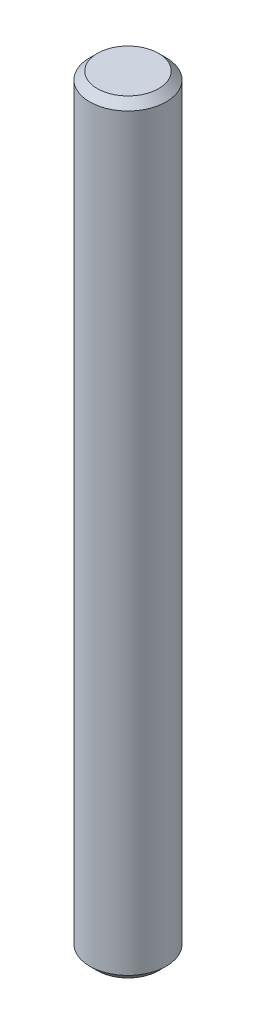
ISO-10303-21;
HEADER;
FILE_DESCRIPTION(('STEP AP214'),'2;1');
FILE_NAME('part.step','',(''),(''),'','','');
FILE_SCHEMA(('AUTOMOTIVE_DESIGN { 1 0 10303 214 1 1 1 1 }'));
ENDSEC;
DATA;
#1=APPLICATION_CONTEXT('core data for automotive mechanical design processes');
#2=APPLICATION_PROTOCOL_DEFINITION('international standard','automotive_design',2000,#1);
#3=PRODUCT_CONTEXT('',#1,'mechanical');
#4=PRODUCT('Part','Part','',(#3));
#5=PRODUCT_RELATED_PRODUCT_CATEGORY('part','',(#4));
#6=PRODUCT_DEFINITION_FORMATION('','',#4);
#7=PRODUCT_DEFINITION_CONTEXT('part definition',#1,'design');
#8=PRODUCT_DEFINITION('design','',#6,#7);
#9=PRODUCT_DEFINITION_SHAPE('','',#8);
#10=(LENGTH_UNIT() NAMED_UNIT(*) SI_UNIT(.MILLI.,.METRE.));
#11=(NAMED_UNIT(*) PLANE_ANGLE_UNIT() SI_UNIT($,.RADIAN.));
#12=(NAMED_UNIT(*) SI_UNIT($,.STERADIAN.) SOLID_ANGLE_UNIT());
#13=UNCERTAINTY_MEASURE_WITH_UNIT(LENGTH_MEASURE(1.E-05),#10,'distance_accuracy_value','');
#14=(GEOMETRIC_REPRESENTATION_CONTEXT(3) GLOBAL_UNCERTAINTY_ASSIGNED_CONTEXT((#13)) GLOBAL_UNIT_ASSIGNED_CONTEXT((#10,
#11,#12)) REPRESENTATION_CONTEXT('',''));
#15=CARTESIAN_POINT('',(0.,0.,0.));
#16=DIRECTION('',(0.,0.,1.));
#17=DIRECTION('',(1.,0.,0.));
#18=AXIS2_PLACEMENT_3D('',#15,#16,#17);
#19=CARTESIAN_POINT('',(0.,80.,0.));
#20=DIRECTION('',(0.,-1.,0.));
#21=DIRECTION('',(0.,0.,-1.));
#22=AXIS2_PLACEMENT_3D('',#19,#20,#21);
#23=CYLINDRICAL_SURFACE('',#22,4.005);
#24=CARTESIAN_POINT('',(0.,0.800000000000009,0.));
#25=DIRECTION('',(0.,1.,0.));
#26=DIRECTION('',(0.,0.,1.));
#27=AXIS2_PLACEMENT_3D('',#24,#25,#26);
#28=CIRCLE('',#27,4.005);
#29=CARTESIAN_POINT('',(0.,0.800000000000009,4.005));
#30=VERTEX_POINT('',#29);
#31=EDGE_CURVE('E42',#30,#30,#28,.T.);
#32=ORIENTED_EDGE('',*,*,#31,.T.);
#33=EDGE_LOOP('',(#32));
#34=FACE_BOUND('',#33,.T.);
#35=CARTESIAN_POINT('',(0.,79.2,0.));
#36=DIRECTION('',(0.,1.,0.));
#37=DIRECTION('',(0.,0.,1.));
#38=AXIS2_PLACEMENT_3D('',#35,#36,#37);
#39=CIRCLE('',#38,4.005);
#40=CARTESIAN_POINT('',(0.,79.2,4.005));
#41=VERTEX_POINT('',#40);
#42=EDGE_CURVE('E46',#41,#41,#39,.F.);
#43=ORIENTED_EDGE('',*,*,#42,.T.);
#44=EDGE_LOOP('',(#43));
#45=FACE_BOUND('',#44,.T.);
#46=ADVANCED_FACE('F31',(#34,#45),#23,.T.);
#47=CARTESIAN_POINT('',(0.,80.,0.));
#48=DIRECTION('',(0.,1.,0.));
#49=DIRECTION('',(0.,0.,1.));
#50=AXIS2_PLACEMENT_3D('',#47,#48,#49);
#51=PLANE('',#50);
#52=CARTESIAN_POINT('',(0.,80.,0.));
#53=DIRECTION('',(0.,1.,0.));
#54=DIRECTION('',(0.,0.,1.));
#55=AXIS2_PLACEMENT_3D('',#52,#53,#54);
#56=CIRCLE('',#55,3.205);
#57=CARTESIAN_POINT('',(0.,80.,3.205));
#58=VERTEX_POINT('',#57);
#59=EDGE_CURVE('E10',#58,#58,#56,.T.);
#60=ORIENTED_EDGE('',*,*,#59,.T.);
#61=EDGE_LOOP('',(#60));
#62=FACE_BOUND('',#61,.T.);
#63=ADVANCED_FACE('F62',(#62),#51,.T.);
#64=CARTESIAN_POINT('',(0.,0.,0.));
#65=DIRECTION('',(0.,1.,0.));
#66=DIRECTION('',(0.,0.,1.));
#67=AXIS2_PLACEMENT_3D('',#64,#65,#66);
#68=PLANE('',#67);
#69=CARTESIAN_POINT('',(0.,0.,0.));
#70=DIRECTION('',(0.,1.,0.));
#71=DIRECTION('',(0.,0.,1.));
#72=AXIS2_PLACEMENT_3D('',#69,#70,#71);
#73=CIRCLE('',#72,3.205);
#74=CARTESIAN_POINT('',(0.,0.,3.205));
#75=VERTEX_POINT('',#74);
#76=EDGE_CURVE('E38',#75,#75,#73,.F.);
#77=ORIENTED_EDGE('',*,*,#76,.T.);
#78=EDGE_LOOP('',(#77));
#79=FACE_BOUND('',#78,.T.);
#80=ADVANCED_FACE('F59',(#79),#68,.F.);
#81=CARTESIAN_POINT('',(0.,0.800000000000009,0.));
#82=DIRECTION('',(0.,1.,0.));
#83=DIRECTION('',(0.,0.,1.));
#84=AXIS2_PLACEMENT_3D('',#81,#82,#83);
#85=CONICAL_SURFACE('',#84,4.005,0.785398163397444);
#86=ORIENTED_EDGE('',*,*,#76,.F.);
#87=EDGE_LOOP('',(#86));
#88=FACE_BOUND('',#87,.T.);
#89=ORIENTED_EDGE('',*,*,#31,.F.);
#90=EDGE_LOOP('',(#89));
#91=FACE_BOUND('',#90,.T.);
#92=ADVANCED_FACE('F55',(#88,#91),#85,.T.);
#93=CARTESIAN_POINT('',(0.,80.,0.));
#94=DIRECTION('',(0.,-1.,0.));
#95=DIRECTION('',(0.,0.,-1.));
#96=AXIS2_PLACEMENT_3D('',#93,#94,#95);
#97=CONICAL_SURFACE('',#96,3.205,0.785398163397444);
#98=ORIENTED_EDGE('',*,*,#42,.F.);
#99=EDGE_LOOP('',(#98));
#100=FACE_BOUND('',#99,.T.);
#101=ORIENTED_EDGE('',*,*,#59,.F.);
#102=EDGE_LOOP('',(#101));
#103=FACE_BOUND('',#102,.T.);
#104=ADVANCED_FACE('F33',(#100,#103),#97,.T.);
#105=CLOSED_SHELL('',(#46,#63,#80,#92,#104));
#106=MANIFOLD_SOLID_BREP('B2',#105);
#107=ADVANCED_BREP_SHAPE_REPRESENTATION('',(#18,#106),#14);
#108=SHAPE_DEFINITION_REPRESENTATION(#9,#107);
ENDSEC;
END-ISO-10303-21;
